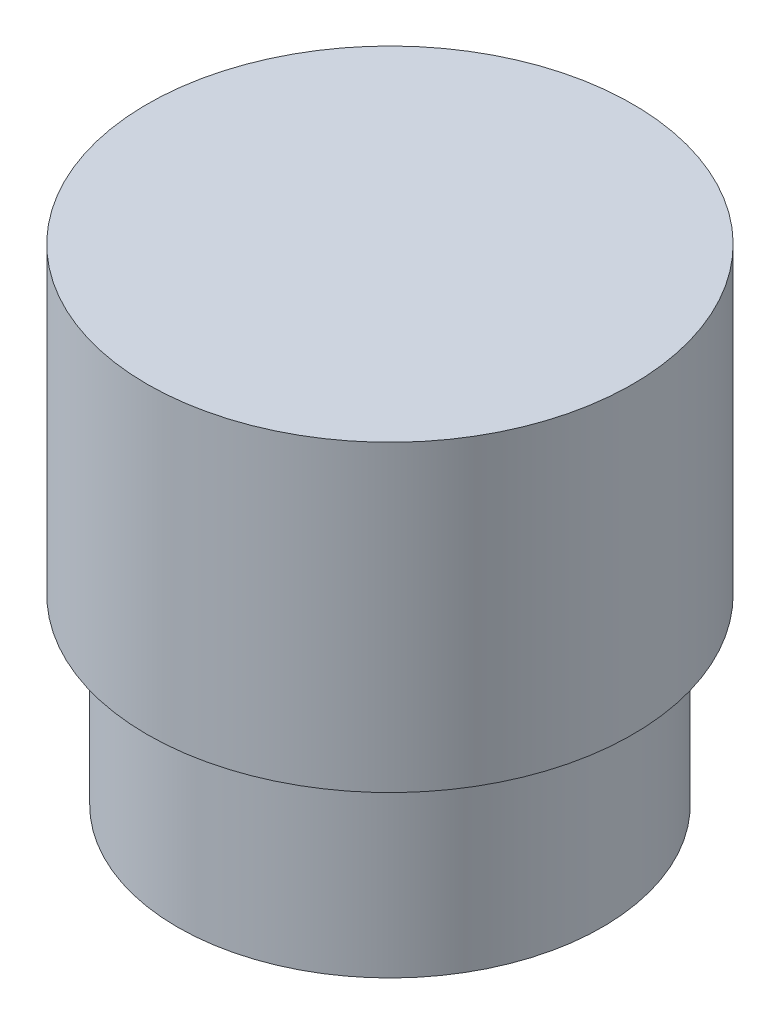
ISO-10303-21;
HEADER;
FILE_DESCRIPTION(('STEP AP214'),'2;1');
FILE_NAME('part.step','',(''),(''),'','','');
FILE_SCHEMA(('AUTOMOTIVE_DESIGN { 1 0 10303 214 1 1 1 1 }'));
ENDSEC;
DATA;
#1=APPLICATION_CONTEXT('core data for automotive mechanical design processes');
#2=APPLICATION_PROTOCOL_DEFINITION('international standard','automotive_design',2000,#1);
#3=PRODUCT_CONTEXT('',#1,'mechanical');
#4=PRODUCT('Part','Part','',(#3));
#5=PRODUCT_RELATED_PRODUCT_CATEGORY('part','',(#4));
#6=PRODUCT_DEFINITION_FORMATION('','',#4);
#7=PRODUCT_DEFINITION_CONTEXT('part definition',#1,'design');
#8=PRODUCT_DEFINITION('design','',#6,#7);
#9=PRODUCT_DEFINITION_SHAPE('','',#8);
#10=(LENGTH_UNIT() NAMED_UNIT(*) SI_UNIT(.MILLI.,.METRE.));
#11=(NAMED_UNIT(*) PLANE_ANGLE_UNIT() SI_UNIT($,.RADIAN.));
#12=(NAMED_UNIT(*) SI_UNIT($,.STERADIAN.) SOLID_ANGLE_UNIT());
#13=UNCERTAINTY_MEASURE_WITH_UNIT(LENGTH_MEASURE(1.E-05),#10,'distance_accuracy_value','');
#14=(GEOMETRIC_REPRESENTATION_CONTEXT(3) GLOBAL_UNCERTAINTY_ASSIGNED_CONTEXT((#13)) GLOBAL_UNIT_ASSIGNED_CONTEXT((#10,
#11,#12)) REPRESENTATION_CONTEXT('',''));
#15=CARTESIAN_POINT('',(0.,0.,0.));
#16=DIRECTION('',(0.,0.,1.));
#17=DIRECTION('',(1.,0.,0.));
#18=AXIS2_PLACEMENT_3D('',#15,#16,#17);
#19=CARTESIAN_POINT('',(0.,0.,0.));
#20=DIRECTION('',(0.,1.,0.));
#21=DIRECTION('',(0.,0.,1.));
#22=AXIS2_PLACEMENT_3D('',#19,#20,#21);
#23=PLANE('',#22);
#24=CARTESIAN_POINT('',(0.,0.,0.));
#25=DIRECTION('',(0.,-1.,0.));
#26=DIRECTION('',(0.,0.,-1.));
#27=AXIS2_PLACEMENT_3D('',#24,#25,#26);
#28=CIRCLE('',#27,2.775);
#29=CARTESIAN_POINT('',(0.,0.,-2.775));
#30=VERTEX_POINT('',#29);
#31=EDGE_CURVE('E67',#30,#30,#28,.T.);
#32=ORIENTED_EDGE('',*,*,#31,.F.);
#33=EDGE_LOOP('',(#32));
#34=FACE_BOUND('',#33,.T.);
#35=CARTESIAN_POINT('',(0.,0.,0.));
#36=DIRECTION('',(0.,1.,0.));
#37=DIRECTION('',(0.,0.,1.));
#38=AXIS2_PLACEMENT_3D('',#35,#36,#37);
#39=CIRCLE('',#38,3.5);
#40=CARTESIAN_POINT('',(0.,0.,3.5));
#41=VERTEX_POINT('',#40);
#42=EDGE_CURVE('E10',#41,#41,#39,.T.);
#43=ORIENTED_EDGE('',*,*,#42,.F.);
#44=EDGE_LOOP('',(#43));
#45=FACE_BOUND('',#44,.T.);
#46=ADVANCED_FACE('F43',(#34,#45),#23,.F.);
#47=CARTESIAN_POINT('',(0.,8.,0.));
#48=DIRECTION('',(0.,1.,0.));
#49=DIRECTION('',(0.,0.,1.));
#50=AXIS2_PLACEMENT_3D('',#47,#48,#49);
#51=CYLINDRICAL_SURFACE('',#50,3.5);
#52=CARTESIAN_POINT('',(0.,3.,0.));
#53=DIRECTION('',(0.,1.,0.));
#54=DIRECTION('',(0.,0.,1.));
#55=AXIS2_PLACEMENT_3D('',#52,#53,#54);
#56=CIRCLE('',#55,3.5);
#57=CARTESIAN_POINT('',(0.,3.,3.5));
#58=VERTEX_POINT('',#57);
#59=EDGE_CURVE('E50',#58,#58,#56,.T.);
#60=ORIENTED_EDGE('',*,*,#59,.F.);
#61=EDGE_LOOP('',(#60));
#62=FACE_BOUND('',#61,.T.);
#63=ORIENTED_EDGE('',*,*,#42,.T.);
#64=EDGE_LOOP('',(#63));
#65=FACE_BOUND('',#64,.T.);
#66=ADVANCED_FACE('F86',(#62,#65),#51,.T.);
#67=CARTESIAN_POINT('',(3.5,3.,0.));
#68=DIRECTION('',(0.,1.,0.));
#69=DIRECTION('',(0.,0.,1.));
#70=AXIS2_PLACEMENT_3D('',#67,#68,#69);
#71=PLANE('',#70);
#72=CARTESIAN_POINT('',(0.,3.,0.));
#73=DIRECTION('',(0.,1.,0.));
#74=DIRECTION('',(0.,0.,1.));
#75=AXIS2_PLACEMENT_3D('',#72,#73,#74);
#76=CIRCLE('',#75,4.);
#77=CARTESIAN_POINT('',(0.,3.,4.));
#78=VERTEX_POINT('',#77);
#79=EDGE_CURVE('E55',#78,#78,#76,.T.);
#80=ORIENTED_EDGE('',*,*,#79,.F.);
#81=EDGE_LOOP('',(#80));
#82=FACE_BOUND('',#81,.T.);
#83=ORIENTED_EDGE('',*,*,#59,.T.);
#84=EDGE_LOOP('',(#83));
#85=FACE_BOUND('',#84,.T.);
#86=ADVANCED_FACE('F91',(#82,#85),#71,.F.);
#87=CARTESIAN_POINT('',(0.,8.,0.));
#88=DIRECTION('',(0.,1.,0.));
#89=DIRECTION('',(0.,0.,1.));
#90=AXIS2_PLACEMENT_3D('',#87,#88,#89);
#91=CYLINDRICAL_SURFACE('',#90,4.);
#92=CARTESIAN_POINT('',(0.,8.,0.));
#93=DIRECTION('',(0.,1.,0.));
#94=DIRECTION('',(0.,0.,1.));
#95=AXIS2_PLACEMENT_3D('',#92,#93,#94);
#96=CIRCLE('',#95,4.);
#97=CARTESIAN_POINT('',(0.,8.,4.));
#98=VERTEX_POINT('',#97);
#99=EDGE_CURVE('E60',#98,#98,#96,.T.);
#100=ORIENTED_EDGE('',*,*,#99,.F.);
#101=EDGE_LOOP('',(#100));
#102=FACE_BOUND('',#101,.T.);
#103=ORIENTED_EDGE('',*,*,#79,.T.);
#104=EDGE_LOOP('',(#103));
#105=FACE_BOUND('',#104,.T.);
#106=ADVANCED_FACE('F96',(#102,#105),#91,.T.);
#107=CARTESIAN_POINT('',(4.,8.,0.));
#108=DIRECTION('',(0.,-1.,0.));
#109=DIRECTION('',(0.,0.,-1.));
#110=AXIS2_PLACEMENT_3D('',#107,#108,#109);
#111=PLANE('',#110);
#112=ORIENTED_EDGE('',*,*,#99,.T.);
#113=EDGE_LOOP('',(#112));
#114=FACE_BOUND('',#113,.T.);
#115=ADVANCED_FACE('F80',(#114),#111,.F.);
#116=CARTESIAN_POINT('',(0.,3.,0.));
#117=DIRECTION('',(0.,-1.,0.));
#118=DIRECTION('',(0.,0.,-1.));
#119=AXIS2_PLACEMENT_3D('',#116,#117,#118);
#120=CYLINDRICAL_SURFACE('',#119,2.775);
#121=CARTESIAN_POINT('',(0.,3.,0.));
#122=DIRECTION('',(0.,-1.,0.));
#123=DIRECTION('',(0.,0.,-1.));
#124=AXIS2_PLACEMENT_3D('',#121,#122,#123);
#125=CIRCLE('',#124,2.775);
#126=CARTESIAN_POINT('',(0.,3.,-2.775));
#127=VERTEX_POINT('',#126);
#128=EDGE_CURVE('E66',#127,#127,#125,.T.);
#129=ORIENTED_EDGE('',*,*,#128,.F.);
#130=EDGE_LOOP('',(#129));
#131=FACE_BOUND('',#130,.T.);
#132=ORIENTED_EDGE('',*,*,#31,.T.);
#133=EDGE_LOOP('',(#132));
#134=FACE_BOUND('',#133,.T.);
#135=ADVANCED_FACE('F77',(#131,#134),#120,.F.);
#136=CARTESIAN_POINT('',(0.,3.,0.));
#137=DIRECTION('',(0.,-1.,0.));
#138=DIRECTION('',(0.,0.,-1.));
#139=AXIS2_PLACEMENT_3D('',#136,#137,#138);
#140=PLANE('',#139);
#141=ORIENTED_EDGE('',*,*,#128,.T.);
#142=EDGE_LOOP('',(#141));
#143=FACE_BOUND('',#142,.T.);
#144=ADVANCED_FACE('F75',(#143),#140,.T.);
#145=CLOSED_SHELL('',(#46,#66,#86,#106,#115,#135,#144));
#146=MANIFOLD_SOLID_BREP('B2',#145);
#147=ADVANCED_BREP_SHAPE_REPRESENTATION('',(#18,#146),#14);
#148=SHAPE_DEFINITION_REPRESENTATION(#9,#147);
ENDSEC;
END-ISO-10303-21;
